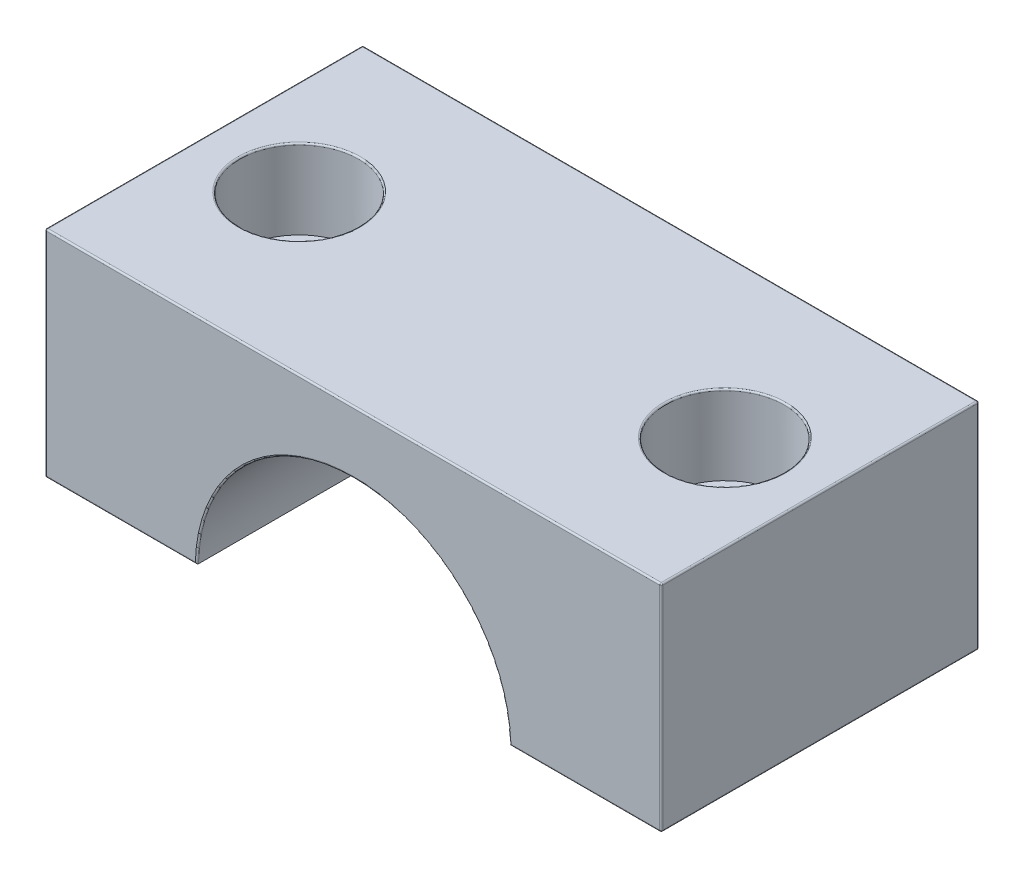
ISO-10303-21;
HEADER;
FILE_DESCRIPTION(('STEP AP214'),'2;1');
FILE_NAME('part.step','',(''),(''),'','','');
FILE_SCHEMA(('AUTOMOTIVE_DESIGN { 1 0 10303 214 1 1 1 1 }'));
ENDSEC;
DATA;
#1=APPLICATION_CONTEXT('core data for automotive mechanical design processes');
#2=APPLICATION_PROTOCOL_DEFINITION('international standard','automotive_design',2000,#1);
#3=PRODUCT_CONTEXT('',#1,'mechanical');
#4=PRODUCT('Part','Part','',(#3));
#5=PRODUCT_RELATED_PRODUCT_CATEGORY('part','',(#4));
#6=PRODUCT_DEFINITION_FORMATION('','',#4);
#7=PRODUCT_DEFINITION_CONTEXT('part definition',#1,'design');
#8=PRODUCT_DEFINITION('design','',#6,#7);
#9=PRODUCT_DEFINITION_SHAPE('','',#8);
#10=(LENGTH_UNIT() NAMED_UNIT(*) SI_UNIT(.MILLI.,.METRE.));
#11=(NAMED_UNIT(*) PLANE_ANGLE_UNIT() SI_UNIT($,.RADIAN.));
#12=(NAMED_UNIT(*) SI_UNIT($,.STERADIAN.) SOLID_ANGLE_UNIT());
#13=UNCERTAINTY_MEASURE_WITH_UNIT(LENGTH_MEASURE(1.E-05),#10,'distance_accuracy_value','');
#14=(GEOMETRIC_REPRESENTATION_CONTEXT(3) GLOBAL_UNCERTAINTY_ASSIGNED_CONTEXT((#13)) GLOBAL_UNIT_ASSIGNED_CONTEXT((#10,
#11,#12)) REPRESENTATION_CONTEXT('',''));
#15=CARTESIAN_POINT('',(0.,0.,0.));
#16=DIRECTION('',(0.,0.,1.));
#17=DIRECTION('',(1.,0.,0.));
#18=AXIS2_PLACEMENT_3D('',#15,#16,#17);
#19=CARTESIAN_POINT('',(-24.638,0.25,12.7));
#20=DIRECTION('',(1.,0.,0.));
#21=DIRECTION('',(0.,0.,-1.));
#22=AXIS2_PLACEMENT_3D('',#19,#20,#21);
#23=PLANE('',#22);
#24=DIRECTION('',(0.,-1.,0.));
#25=VECTOR('',#24,1.);
#26=CARTESIAN_POINT('',(-24.638,0.25,-12.573));
#27=LINE('',#26,#25);
#28=CARTESIAN_POINT('',(-24.638,17.3355,-12.573));
#29=VERTEX_POINT('',#28);
#30=CARTESIAN_POINT('',(-24.638,0.377,-12.573));
#31=VERTEX_POINT('',#30);
#32=EDGE_CURVE('E235',#29,#31,#27,.T.);
#33=ORIENTED_EDGE('',*,*,#32,.T.);
#34=DIRECTION('',(0.,0.,-1.));
#35=VECTOR('',#34,1.);
#36=CARTESIAN_POINT('',(-24.638,0.377,12.7));
#37=LINE('',#36,#35);
#38=CARTESIAN_POINT('',(-24.638,0.377,12.573));
#39=VERTEX_POINT('',#38);
#40=EDGE_CURVE('E237',#31,#39,#37,.F.);
#41=ORIENTED_EDGE('',*,*,#40,.T.);
#42=DIRECTION('',(0.,-1.,0.));
#43=VECTOR('',#42,1.);
#44=CARTESIAN_POINT('',(-24.638,17.4625,12.573));
#45=LINE('',#44,#43);
#46=CARTESIAN_POINT('',(-24.638,17.3355,12.573));
#47=VERTEX_POINT('',#46);
#48=EDGE_CURVE('E231',#39,#47,#45,.F.);
#49=ORIENTED_EDGE('',*,*,#48,.T.);
#50=DIRECTION('',(0.,0.,-1.));
#51=VECTOR('',#50,1.);
#52=CARTESIAN_POINT('',(-24.638,17.3355,12.7));
#53=LINE('',#52,#51);
#54=EDGE_CURVE('E233',#47,#29,#53,.T.);
#55=ORIENTED_EDGE('',*,*,#54,.T.);
#56=EDGE_LOOP('',(#33,#41,#49,#55));
#57=FACE_BOUND('',#56,.T.);
#58=ADVANCED_FACE('F41',(#57),#23,.F.);
#59=CARTESIAN_POINT('',(-24.638,0.25,12.7));
#60=DIRECTION('',(0.,1.,0.));
#61=DIRECTION('',(0.,0.,1.));
#62=AXIS2_PLACEMENT_3D('',#59,#60,#61);
#63=PLANE('',#62);
#64=CARTESIAN_POINT('',(-17.018,0.25,0.));
#65=DIRECTION('',(0.,1.,0.));
#66=DIRECTION('',(0.,0.,1.));
#67=AXIS2_PLACEMENT_3D('',#64,#65,#66);
#68=CIRCLE('',#67,3.175);
#69=CARTESIAN_POINT('',(-17.018,0.25,3.175));
#70=VERTEX_POINT('',#69);
#71=EDGE_CURVE('E195',#70,#70,#68,.T.);
#72=ORIENTED_EDGE('',*,*,#71,.T.);
#73=EDGE_LOOP('',(#72));
#74=FACE_BOUND('',#73,.T.);
#75=DIRECTION('',(0.,0.,-1.));
#76=VECTOR('',#75,1.);
#77=CARTESIAN_POINT('',(-24.511,0.25,12.7));
#78=LINE('',#77,#76);
#79=CARTESIAN_POINT('',(-24.511,0.25,12.573));
#80=VERTEX_POINT('',#79);
#81=CARTESIAN_POINT('',(-24.511,0.25,-12.573));
#82=VERTEX_POINT('',#81);
#83=EDGE_CURVE('E210',#80,#82,#78,.T.);
#84=ORIENTED_EDGE('',*,*,#83,.T.);
#85=DIRECTION('',(1.,0.,0.));
#86=VECTOR('',#85,1.);
#87=CARTESIAN_POINT('',(-24.638,0.25,-12.573));
#88=LINE('',#87,#86);
#89=CARTESIAN_POINT('',(-12.49749974995,0.25,-12.573));
#90=VERTEX_POINT('',#89);
#91=EDGE_CURVE('E212',#82,#90,#88,.T.);
#92=ORIENTED_EDGE('',*,*,#91,.T.);
#93=DIRECTION('',(0.,0.,-1.));
#94=VECTOR('',#93,1.);
#95=CARTESIAN_POINT('',(-12.49749974995,0.25,12.7));
#96=LINE('',#95,#94);
#97=CARTESIAN_POINT('',(-12.49749974995,0.25,12.573));
#98=VERTEX_POINT('',#97);
#99=EDGE_CURVE('E189',#98,#90,#96,.T.);
#100=ORIENTED_EDGE('',*,*,#99,.F.);
#101=DIRECTION('',(1.,0.,0.));
#102=VECTOR('',#101,1.);
#103=CARTESIAN_POINT('',(-24.638,0.25,12.573));
#104=LINE('',#103,#102);
#105=EDGE_CURVE('E208',#98,#80,#104,.F.);
#106=ORIENTED_EDGE('',*,*,#105,.T.);
#107=EDGE_LOOP('',(#84,#92,#100,#106));
#108=FACE_BOUND('',#107,.T.);
#109=ADVANCED_FACE('F366',(#74,#108),#63,.F.);
#110=CARTESIAN_POINT('',(0.,0.,12.7));
#111=DIRECTION('',(0.,0.,-1.));
#112=DIRECTION('',(-1.,0.,0.));
#113=AXIS2_PLACEMENT_3D('',#110,#111,#112);
#114=CYLINDRICAL_SURFACE('',#113,12.5);
#115=ORIENTED_EDGE('',*,*,#99,.T.);
#116=CARTESIAN_POINT('',(0.,0.,-12.573));
#117=DIRECTION('',(0.,0.,1.));
#118=DIRECTION('',(1.,0.,0.));
#119=AXIS2_PLACEMENT_3D('',#116,#117,#118);
#120=CIRCLE('',#119,12.5);
#121=CARTESIAN_POINT('',(12.49749974995,0.25,-12.573));
#122=VERTEX_POINT('',#121);
#123=EDGE_CURVE('E229',#90,#122,#120,.F.);
#124=ORIENTED_EDGE('',*,*,#123,.T.);
#125=DIRECTION('',(0.,0.,-1.));
#126=VECTOR('',#125,1.);
#127=CARTESIAN_POINT('',(12.49749974995,0.25,12.7));
#128=LINE('',#127,#126);
#129=CARTESIAN_POINT('',(12.49749974995,0.25,12.573));
#130=VERTEX_POINT('',#129);
#131=EDGE_CURVE('E192',#130,#122,#128,.T.);
#132=ORIENTED_EDGE('',*,*,#131,.F.);
#133=CARTESIAN_POINT('',(0.,0.,12.573));
#134=DIRECTION('',(0.,0.,1.));
#135=DIRECTION('',(1.,0.,0.));
#136=AXIS2_PLACEMENT_3D('',#133,#134,#135);
#137=CIRCLE('',#136,12.5);
#138=EDGE_CURVE('E227',#130,#98,#137,.T.);
#139=ORIENTED_EDGE('',*,*,#138,.T.);
#140=EDGE_LOOP('',(#115,#124,#132,#139));
#141=FACE_BOUND('',#140,.T.);
#142=ADVANCED_FACE('F373',(#141),#114,.F.);
#143=CARTESIAN_POINT('',(12.49749974995,0.25,12.7));
#144=DIRECTION('',(0.,1.,0.));
#145=DIRECTION('',(0.,0.,1.));
#146=AXIS2_PLACEMENT_3D('',#143,#144,#145);
#147=PLANE('',#146);
#148=CARTESIAN_POINT('',(17.018,0.25,0.));
#149=DIRECTION('',(0.,1.,0.));
#150=DIRECTION('',(0.,0.,1.));
#151=AXIS2_PLACEMENT_3D('',#148,#149,#150);
#152=CIRCLE('',#151,3.175);
#153=CARTESIAN_POINT('',(17.018,0.25,3.175));
#154=VERTEX_POINT('',#153);
#155=EDGE_CURVE('E542',#154,#154,#152,.T.);
#156=ORIENTED_EDGE('',*,*,#155,.T.);
#157=EDGE_LOOP('',(#156));
#158=FACE_BOUND('',#157,.T.);
#159=ORIENTED_EDGE('',*,*,#131,.T.);
#160=DIRECTION('',(1.,0.,0.));
#161=VECTOR('',#160,1.);
#162=CARTESIAN_POINT('',(12.49749974995,0.25,-12.573));
#163=LINE('',#162,#161);
#164=CARTESIAN_POINT('',(24.511,0.25,-12.573));
#165=VERTEX_POINT('',#164);
#166=EDGE_CURVE('E206',#122,#165,#163,.T.);
#167=ORIENTED_EDGE('',*,*,#166,.T.);
#168=DIRECTION('',(0.,0.,-1.));
#169=VECTOR('',#168,1.);
#170=CARTESIAN_POINT('',(24.511,0.25,12.7));
#171=LINE('',#170,#169);
#172=CARTESIAN_POINT('',(24.511,0.25,12.573));
#173=VERTEX_POINT('',#172);
#174=EDGE_CURVE('E203',#165,#173,#171,.F.);
#175=ORIENTED_EDGE('',*,*,#174,.T.);
#176=DIRECTION('',(1.,0.,0.));
#177=VECTOR('',#176,1.);
#178=CARTESIAN_POINT('',(12.49749974995,0.25,12.573));
#179=LINE('',#178,#177);
#180=EDGE_CURVE('E201',#173,#130,#179,.F.);
#181=ORIENTED_EDGE('',*,*,#180,.T.);
#182=EDGE_LOOP('',(#159,#167,#175,#181));
#183=FACE_BOUND('',#182,.T.);
#184=ADVANCED_FACE('F448',(#158,#183),#147,.F.);
#185=CARTESIAN_POINT('',(24.638,17.4625,12.7));
#186=DIRECTION('',(-1.,0.,0.));
#187=DIRECTION('',(0.,-1.,0.));
#188=AXIS2_PLACEMENT_3D('',#185,#186,#187);
#189=PLANE('',#188);
#190=DIRECTION('',(0.,1.,0.));
#191=VECTOR('',#190,1.);
#192=CARTESIAN_POINT('',(24.638,0.25,12.573));
#193=LINE('',#192,#191);
#194=CARTESIAN_POINT('',(24.638,17.3355,12.573));
#195=VERTEX_POINT('',#194);
#196=CARTESIAN_POINT('',(24.638,0.376999999999999,12.573));
#197=VERTEX_POINT('',#196);
#198=EDGE_CURVE('E157',#195,#197,#193,.F.);
#199=ORIENTED_EDGE('',*,*,#198,.T.);
#200=DIRECTION('',(0.,0.,-1.));
#201=VECTOR('',#200,1.);
#202=CARTESIAN_POINT('',(24.638,0.376999999999999,12.7));
#203=LINE('',#202,#201);
#204=CARTESIAN_POINT('',(24.638,0.376999999999999,-12.573));
#205=VERTEX_POINT('',#204);
#206=EDGE_CURVE('E199',#197,#205,#203,.T.);
#207=ORIENTED_EDGE('',*,*,#206,.T.);
#208=DIRECTION('',(0.,1.,0.));
#209=VECTOR('',#208,1.);
#210=CARTESIAN_POINT('',(24.638,17.4625,-12.573));
#211=LINE('',#210,#209);
#212=CARTESIAN_POINT('',(24.638,17.3355,-12.573));
#213=VERTEX_POINT('',#212);
#214=EDGE_CURVE('E160',#205,#213,#211,.T.);
#215=ORIENTED_EDGE('',*,*,#214,.T.);
#216=DIRECTION('',(0.,0.,-1.));
#217=VECTOR('',#216,1.);
#218=CARTESIAN_POINT('',(24.638,17.3355,12.7));
#219=LINE('',#218,#217);
#220=EDGE_CURVE('E152',#213,#195,#219,.F.);
#221=ORIENTED_EDGE('',*,*,#220,.T.);
#222=EDGE_LOOP('',(#199,#207,#215,#221));
#223=FACE_BOUND('',#222,.T.);
#224=ADVANCED_FACE('F154',(#223),#189,.F.);
#225=CARTESIAN_POINT('',(-24.638,17.4625,12.7));
#226=DIRECTION('',(0.,-1.,0.));
#227=DIRECTION('',(1.,0.,0.));
#228=AXIS2_PLACEMENT_3D('',#225,#226,#227);
#229=PLANE('',#228);
#230=CARTESIAN_POINT('',(-17.018,17.4625,0.));
#231=DIRECTION('',(0.,-1.,0.));
#232=DIRECTION('',(1.,0.,0.));
#233=AXIS2_PLACEMENT_3D('',#230,#231,#232);
#234=CIRCLE('',#233,4.8895);
#235=CARTESIAN_POINT('',(-12.1285,17.4625,0.));
#236=VERTEX_POINT('',#235);
#237=EDGE_CURVE('E250',#236,#236,#234,.T.);
#238=ORIENTED_EDGE('',*,*,#237,.T.);
#239=EDGE_LOOP('',(#238));
#240=FACE_BOUND('',#239,.T.);
#241=CARTESIAN_POINT('',(17.018,17.4625,0.));
#242=DIRECTION('',(0.,-1.,0.));
#243=DIRECTION('',(1.,0.,0.));
#244=AXIS2_PLACEMENT_3D('',#241,#242,#243);
#245=CIRCLE('',#244,4.8895);
#246=CARTESIAN_POINT('',(21.9075,17.4625,0.));
#247=VERTEX_POINT('',#246);
#248=EDGE_CURVE('E247',#247,#247,#245,.T.);
#249=ORIENTED_EDGE('',*,*,#248,.T.);
#250=EDGE_LOOP('',(#249));
#251=FACE_BOUND('',#250,.T.);
#252=DIRECTION('',(0.,0.,-1.));
#253=VECTOR('',#252,1.);
#254=CARTESIAN_POINT('',(24.511,17.4625,12.7));
#255=LINE('',#254,#253);
#256=CARTESIAN_POINT('',(24.511,17.4625,12.573));
#257=VERTEX_POINT('',#256);
#258=CARTESIAN_POINT('',(24.511,17.4625,-12.573));
#259=VERTEX_POINT('',#258);
#260=EDGE_CURVE('E171',#257,#259,#255,.T.);
#261=ORIENTED_EDGE('',*,*,#260,.T.);
#262=DIRECTION('',(-1.,0.,0.));
#263=VECTOR('',#262,1.);
#264=CARTESIAN_POINT('',(-24.638,17.4625,-12.573));
#265=LINE('',#264,#263);
#266=CARTESIAN_POINT('',(-24.511,17.4625,-12.573));
#267=VERTEX_POINT('',#266);
#268=EDGE_CURVE('E245',#259,#267,#265,.T.);
#269=ORIENTED_EDGE('',*,*,#268,.T.);
#270=DIRECTION('',(0.,0.,-1.));
#271=VECTOR('',#270,1.);
#272=CARTESIAN_POINT('',(-24.511,17.4625,12.7));
#273=LINE('',#272,#271);
#274=CARTESIAN_POINT('',(-24.511,17.4625,12.573));
#275=VERTEX_POINT('',#274);
#276=EDGE_CURVE('E242',#267,#275,#273,.F.);
#277=ORIENTED_EDGE('',*,*,#276,.T.);
#278=DIRECTION('',(-1.,0.,0.));
#279=VECTOR('',#278,1.);
#280=CARTESIAN_POINT('',(24.638,17.4625,12.573));
#281=LINE('',#280,#279);
#282=EDGE_CURVE('E240',#275,#257,#281,.F.);
#283=ORIENTED_EDGE('',*,*,#282,.T.);
#284=EDGE_LOOP('',(#261,#269,#277,#283));
#285=FACE_BOUND('',#284,.T.);
#286=ADVANCED_FACE('F413',(#240,#251,#285),#229,.F.);
#287=CARTESIAN_POINT('',(0.,0.,12.7));
#288=DIRECTION('',(0.,0.,1.));
#289=DIRECTION('',(1.,0.,0.));
#290=AXIS2_PLACEMENT_3D('',#287,#288,#289);
#291=PLANE('',#290);
#292=DIRECTION('',(0.,1.,0.));
#293=VECTOR('',#292,1.);
#294=CARTESIAN_POINT('',(24.511,17.4625,12.7));
#295=LINE('',#294,#293);
#296=CARTESIAN_POINT('',(24.511,0.377,12.7));
#297=VERTEX_POINT('',#296);
#298=CARTESIAN_POINT('',(24.511,17.3355,12.7));
#299=VERTEX_POINT('',#298);
#300=EDGE_CURVE('E50',#297,#299,#295,.T.);
#301=ORIENTED_EDGE('',*,*,#300,.T.);
#302=DIRECTION('',(-1.,0.,0.));
#303=VECTOR('',#302,1.);
#304=CARTESIAN_POINT('',(-24.638,17.3355,12.7));
#305=LINE('',#304,#303);
#306=CARTESIAN_POINT('',(-24.511,17.3355,12.7));
#307=VERTEX_POINT('',#306);
#308=EDGE_CURVE('E11',#299,#307,#305,.T.);
#309=ORIENTED_EDGE('',*,*,#308,.T.);
#310=DIRECTION('',(0.,-1.,0.));
#311=VECTOR('',#310,1.);
#312=CARTESIAN_POINT('',(-24.511,0.25,12.7));
#313=LINE('',#312,#311);
#314=CARTESIAN_POINT('',(-24.511,0.377,12.7));
#315=VERTEX_POINT('',#314);
#316=EDGE_CURVE('E259',#307,#315,#313,.T.);
#317=ORIENTED_EDGE('',*,*,#316,.T.);
#318=DIRECTION('',(1.,0.,0.));
#319=VECTOR('',#318,1.);
#320=CARTESIAN_POINT('',(-12.49749974995,0.377,12.7));
#321=LINE('',#320,#319);
#322=CARTESIAN_POINT('',(-12.6213707654914,0.377,12.7));
#323=VERTEX_POINT('',#322);
#324=EDGE_CURVE('E261',#315,#323,#321,.T.);
#325=ORIENTED_EDGE('',*,*,#324,.T.);
#326=CARTESIAN_POINT('',(0.,0.,12.7));
#327=DIRECTION('',(0.,0.,1.));
#328=DIRECTION('',(1.,0.,0.));
#329=AXIS2_PLACEMENT_3D('',#326,#327,#328);
#330=CIRCLE('',#329,12.627);
#331=CARTESIAN_POINT('',(12.6213707654914,0.377,12.7));
#332=VERTEX_POINT('',#331);
#333=EDGE_CURVE('E263',#323,#332,#330,.F.);
#334=ORIENTED_EDGE('',*,*,#333,.T.);
#335=DIRECTION('',(1.,0.,0.));
#336=VECTOR('',#335,1.);
#337=CARTESIAN_POINT('',(24.638,0.377,12.7));
#338=LINE('',#337,#336);
#339=EDGE_CURVE('E61',#332,#297,#338,.T.);
#340=ORIENTED_EDGE('',*,*,#339,.T.);
#341=EDGE_LOOP('',(#301,#309,#317,#325,#334,#340));
#342=FACE_BOUND('',#341,.T.);
#343=ADVANCED_FACE('F420',(#342),#291,.T.);
#344=CARTESIAN_POINT('',(0.,0.,-12.7));
#345=DIRECTION('',(0.,0.,1.));
#346=DIRECTION('',(1.,0.,0.));
#347=AXIS2_PLACEMENT_3D('',#344,#345,#346);
#348=PLANE('',#347);
#349=CARTESIAN_POINT('',(0.,0.,-12.7));
#350=DIRECTION('',(0.,0.,1.));
#351=DIRECTION('',(1.,0.,0.));
#352=AXIS2_PLACEMENT_3D('',#349,#350,#351);
#353=CIRCLE('',#352,12.627);
#354=CARTESIAN_POINT('',(12.6213707654914,0.377,-12.7));
#355=VERTEX_POINT('',#354);
#356=CARTESIAN_POINT('',(-12.6213707654914,0.377,-12.7));
#357=VERTEX_POINT('',#356);
#358=EDGE_CURVE('E222',#355,#357,#353,.T.);
#359=ORIENTED_EDGE('',*,*,#358,.T.);
#360=DIRECTION('',(1.,0.,0.));
#361=VECTOR('',#360,1.);
#362=CARTESIAN_POINT('',(0.,0.377,-12.7));
#363=LINE('',#362,#361);
#364=CARTESIAN_POINT('',(-24.511,0.377,-12.7));
#365=VERTEX_POINT('',#364);
#366=EDGE_CURVE('E224',#357,#365,#363,.F.);
#367=ORIENTED_EDGE('',*,*,#366,.T.);
#368=DIRECTION('',(0.,-1.,0.));
#369=VECTOR('',#368,1.);
#370=CARTESIAN_POINT('',(-24.511,0.,-12.7));
#371=LINE('',#370,#369);
#372=CARTESIAN_POINT('',(-24.511,17.3355,-12.7));
#373=VERTEX_POINT('',#372);
#374=EDGE_CURVE('E216',#365,#373,#371,.F.);
#375=ORIENTED_EDGE('',*,*,#374,.T.);
#376=DIRECTION('',(-1.,0.,0.));
#377=VECTOR('',#376,1.);
#378=CARTESIAN_POINT('',(0.,17.3355,-12.7));
#379=LINE('',#378,#377);
#380=CARTESIAN_POINT('',(24.511,17.3355,-12.7));
#381=VERTEX_POINT('',#380);
#382=EDGE_CURVE('E214',#373,#381,#379,.F.);
#383=ORIENTED_EDGE('',*,*,#382,.T.);
#384=DIRECTION('',(0.,1.,0.));
#385=VECTOR('',#384,1.);
#386=CARTESIAN_POINT('',(24.511,0.,-12.7));
#387=LINE('',#386,#385);
#388=CARTESIAN_POINT('',(24.511,0.377,-12.7));
#389=VERTEX_POINT('',#388);
#390=EDGE_CURVE('E218',#381,#389,#387,.F.);
#391=ORIENTED_EDGE('',*,*,#390,.T.);
#392=DIRECTION('',(1.,0.,0.));
#393=VECTOR('',#392,1.);
#394=CARTESIAN_POINT('',(0.,0.377,-12.7));
#395=LINE('',#394,#393);
#396=EDGE_CURVE('E220',#389,#355,#395,.F.);
#397=ORIENTED_EDGE('',*,*,#396,.T.);
#398=EDGE_LOOP('',(#359,#367,#375,#383,#391,#397));
#399=FACE_BOUND('',#398,.T.);
#400=ADVANCED_FACE('F454',(#399),#348,.F.);
#401=CARTESIAN_POINT('',(-17.018,11.1125,0.));
#402=DIRECTION('',(0.,1.,0.));
#403=DIRECTION('',(-1.,0.,0.));
#404=AXIS2_PLACEMENT_3D('',#401,#402,#403);
#405=CYLINDRICAL_SURFACE('',#404,4.7625);
#406=CARTESIAN_POINT('',(-17.018,17.3355,0.));
#407=DIRECTION('',(0.,-1.,0.));
#408=DIRECTION('',(1.,0.,0.));
#409=AXIS2_PLACEMENT_3D('',#406,#407,#408);
#410=CIRCLE('',#409,4.7625);
#411=CARTESIAN_POINT('',(-12.2555,17.3355,0.));
#412=VERTEX_POINT('',#411);
#413=EDGE_CURVE('E253',#412,#412,#410,.F.);
#414=ORIENTED_EDGE('',*,*,#413,.T.);
#415=EDGE_LOOP('',(#414));
#416=FACE_BOUND('',#415,.T.);
#417=CARTESIAN_POINT('',(-17.018,11.1125,0.));
#418=DIRECTION('',(0.,1.,0.));
#419=DIRECTION('',(-1.,0.,0.));
#420=AXIS2_PLACEMENT_3D('',#417,#418,#419);
#421=CIRCLE('',#420,4.7625);
#422=CARTESIAN_POINT('',(-21.7805,11.1125,0.));
#423=VERTEX_POINT('',#422);
#424=EDGE_CURVE('E535',#423,#423,#421,.T.);
#425=ORIENTED_EDGE('',*,*,#424,.F.);
#426=EDGE_LOOP('',(#425));
#427=FACE_BOUND('',#426,.T.);
#428=ADVANCED_FACE('F528',(#416,#427),#405,.F.);
#429=CARTESIAN_POINT('',(-17.018,11.1125,0.));
#430=DIRECTION('',(0.,1.,0.));
#431=DIRECTION('',(-1.,0.,0.));
#432=AXIS2_PLACEMENT_3D('',#429,#430,#431);
#433=PLANE('',#432);
#434=CARTESIAN_POINT('',(-17.018,11.1125,0.));
#435=DIRECTION('',(0.,1.,0.));
#436=DIRECTION('',(-1.,0.,0.));
#437=AXIS2_PLACEMENT_3D('',#434,#435,#436);
#438=CIRCLE('',#437,3.175);
#439=CARTESIAN_POINT('',(-20.193,11.1125,0.));
#440=VERTEX_POINT('',#439);
#441=EDGE_CURVE('E550',#440,#440,#438,.T.);
#442=ORIENTED_EDGE('',*,*,#441,.F.);
#443=EDGE_LOOP('',(#442));
#444=FACE_BOUND('',#443,.T.);
#445=ORIENTED_EDGE('',*,*,#424,.T.);
#446=EDGE_LOOP('',(#445));
#447=FACE_BOUND('',#446,.T.);
#448=ADVANCED_FACE('F531',(#444,#447),#433,.T.);
#449=CARTESIAN_POINT('',(17.018,11.1125,0.));
#450=DIRECTION('',(0.,1.,0.));
#451=DIRECTION('',(-1.,0.,0.));
#452=AXIS2_PLACEMENT_3D('',#449,#450,#451);
#453=CYLINDRICAL_SURFACE('',#452,4.7625);
#454=CARTESIAN_POINT('',(17.018,17.3355,0.));
#455=DIRECTION('',(0.,-1.,0.));
#456=DIRECTION('',(1.,0.,0.));
#457=AXIS2_PLACEMENT_3D('',#454,#455,#456);
#458=CIRCLE('',#457,4.7625);
#459=CARTESIAN_POINT('',(21.7805,17.3355,0.));
#460=VERTEX_POINT('',#459);
#461=EDGE_CURVE('E256',#460,#460,#458,.F.);
#462=ORIENTED_EDGE('',*,*,#461,.T.);
#463=EDGE_LOOP('',(#462));
#464=FACE_BOUND('',#463,.T.);
#465=CARTESIAN_POINT('',(17.018,11.1125,0.));
#466=DIRECTION('',(0.,1.,0.));
#467=DIRECTION('',(-1.,0.,0.));
#468=AXIS2_PLACEMENT_3D('',#465,#466,#467);
#469=CIRCLE('',#468,4.7625);
#470=CARTESIAN_POINT('',(12.2555,11.1125,0.));
#471=VERTEX_POINT('',#470);
#472=EDGE_CURVE('E537',#471,#471,#469,.T.);
#473=ORIENTED_EDGE('',*,*,#472,.F.);
#474=EDGE_LOOP('',(#473));
#475=FACE_BOUND('',#474,.T.);
#476=ADVANCED_FACE('F560',(#464,#475),#453,.F.);
#477=CARTESIAN_POINT('',(17.018,11.1125,0.));
#478=DIRECTION('',(0.,1.,0.));
#479=DIRECTION('',(-1.,0.,0.));
#480=AXIS2_PLACEMENT_3D('',#477,#478,#479);
#481=PLANE('',#480);
#482=CARTESIAN_POINT('',(17.018,11.1125,0.));
#483=DIRECTION('',(0.,1.,0.));
#484=DIRECTION('',(-1.,0.,0.));
#485=AXIS2_PLACEMENT_3D('',#482,#483,#484);
#486=CIRCLE('',#485,3.175);
#487=CARTESIAN_POINT('',(13.843,11.1125,0.));
#488=VERTEX_POINT('',#487);
#489=EDGE_CURVE('E546',#488,#488,#486,.T.);
#490=ORIENTED_EDGE('',*,*,#489,.F.);
#491=EDGE_LOOP('',(#490));
#492=FACE_BOUND('',#491,.T.);
#493=ORIENTED_EDGE('',*,*,#472,.T.);
#494=EDGE_LOOP('',(#493));
#495=FACE_BOUND('',#494,.T.);
#496=ADVANCED_FACE('F566',(#492,#495),#481,.T.);
#497=CARTESIAN_POINT('',(17.018,-38.1,0.));
#498=DIRECTION('',(0.,1.,0.));
#499=DIRECTION('',(-1.,0.,0.));
#500=AXIS2_PLACEMENT_3D('',#497,#498,#499);
#501=CYLINDRICAL_SURFACE('',#500,3.175);
#502=ORIENTED_EDGE('',*,*,#489,.T.);
#503=EDGE_LOOP('',(#502));
#504=FACE_BOUND('',#503,.T.);
#505=ORIENTED_EDGE('',*,*,#155,.F.);
#506=EDGE_LOOP('',(#505));
#507=FACE_BOUND('',#506,.T.);
#508=ADVANCED_FACE('F642',(#504,#507),#501,.F.);
#509=CARTESIAN_POINT('',(-17.018,-38.1,0.));
#510=DIRECTION('',(0.,1.,0.));
#511=DIRECTION('',(-1.,0.,0.));
#512=AXIS2_PLACEMENT_3D('',#509,#510,#511);
#513=CYLINDRICAL_SURFACE('',#512,3.175);
#514=ORIENTED_EDGE('',*,*,#441,.T.);
#515=EDGE_LOOP('',(#514));
#516=FACE_BOUND('',#515,.T.);
#517=ORIENTED_EDGE('',*,*,#71,.F.);
#518=EDGE_LOOP('',(#517));
#519=FACE_BOUND('',#518,.T.);
#520=ADVANCED_FACE('F516',(#516,#519),#513,.F.);
#521=CARTESIAN_POINT('',(-24.511,0.,12.573));
#522=DIRECTION('',(0.,1.,0.));
#523=DIRECTION('',(0.,0.,1.));
#524=AXIS2_PLACEMENT_3D('',#521,#522,#523);
#525=CYLINDRICAL_SURFACE('',#524,0.127);
#526=CARTESIAN_POINT('',(-24.511,17.3355,12.573));
#527=DIRECTION('',(0.,1.,0.));
#528=DIRECTION('',(0.,0.,1.));
#529=AXIS2_PLACEMENT_3D('',#526,#527,#528);
#530=CIRCLE('',#529,0.127);
#531=EDGE_CURVE('E434',#47,#307,#530,.T.);
#532=ORIENTED_EDGE('',*,*,#531,.F.);
#533=ORIENTED_EDGE('',*,*,#48,.F.);
#534=CARTESIAN_POINT('',(-24.511,0.377,12.573));
#535=DIRECTION('',(0.,-1.,0.));
#536=DIRECTION('',(0.,0.,-1.));
#537=AXIS2_PLACEMENT_3D('',#534,#535,#536);
#538=CIRCLE('',#537,0.127);
#539=EDGE_CURVE('E428',#315,#39,#538,.T.);
#540=ORIENTED_EDGE('',*,*,#539,.F.);
#541=ORIENTED_EDGE('',*,*,#316,.F.);
#542=EDGE_LOOP('',(#532,#533,#540,#541));
#543=FACE_BOUND('',#542,.T.);
#544=ADVANCED_FACE('F430',(#543),#525,.T.);
#545=CARTESIAN_POINT('',(-24.511,17.3355,12.7));
#546=DIRECTION('',(0.,0.,-1.));
#547=DIRECTION('',(-1.,0.,0.));
#548=AXIS2_PLACEMENT_3D('',#545,#546,#547);
#549=CYLINDRICAL_SURFACE('',#548,0.127);
#550=CARTESIAN_POINT('',(-24.511,17.3355,-12.573));
#551=DIRECTION('',(0.,0.,-1.));
#552=DIRECTION('',(-1.,0.,0.));
#553=AXIS2_PLACEMENT_3D('',#550,#551,#552);
#554=CIRCLE('',#553,0.127);
#555=EDGE_CURVE('E472',#29,#267,#554,.T.);
#556=ORIENTED_EDGE('',*,*,#555,.F.);
#557=ORIENTED_EDGE('',*,*,#54,.F.);
#558=CARTESIAN_POINT('',(-24.511,17.3355,12.573));
#559=DIRECTION('',(0.,0.,1.));
#560=DIRECTION('',(1.,0.,0.));
#561=AXIS2_PLACEMENT_3D('',#558,#559,#560);
#562=CIRCLE('',#561,0.127);
#563=EDGE_CURVE('E482',#275,#47,#562,.T.);
#564=ORIENTED_EDGE('',*,*,#563,.F.);
#565=ORIENTED_EDGE('',*,*,#276,.F.);
#566=EDGE_LOOP('',(#556,#557,#564,#565));
#567=FACE_BOUND('',#566,.T.);
#568=ADVANCED_FACE('F489',(#567),#549,.T.);
#569=CARTESIAN_POINT('',(-24.511,0.25,-12.573));
#570=DIRECTION('',(0.,-1.,0.));
#571=DIRECTION('',(0.,0.,-1.));
#572=AXIS2_PLACEMENT_3D('',#569,#570,#571);
#573=CYLINDRICAL_SURFACE('',#572,0.127);
#574=CARTESIAN_POINT('',(-24.511,0.377,-12.573));
#575=DIRECTION('',(0.,-1.,0.));
#576=DIRECTION('',(0.,0.,-1.));
#577=AXIS2_PLACEMENT_3D('',#574,#575,#576);
#578=CIRCLE('',#577,0.127);
#579=EDGE_CURVE('E473',#31,#365,#578,.T.);
#580=ORIENTED_EDGE('',*,*,#579,.F.);
#581=ORIENTED_EDGE('',*,*,#32,.F.);
#582=CARTESIAN_POINT('',(-24.511,17.3355,-12.573));
#583=DIRECTION('',(0.,1.,0.));
#584=DIRECTION('',(0.,0.,1.));
#585=AXIS2_PLACEMENT_3D('',#582,#583,#584);
#586=CIRCLE('',#585,0.127);
#587=EDGE_CURVE('E467',#373,#29,#586,.T.);
#588=ORIENTED_EDGE('',*,*,#587,.F.);
#589=ORIENTED_EDGE('',*,*,#374,.F.);
#590=EDGE_LOOP('',(#580,#581,#588,#589));
#591=FACE_BOUND('',#590,.T.);
#592=ADVANCED_FACE('F468',(#591),#573,.T.);
#593=CARTESIAN_POINT('',(-24.511,0.377,12.7));
#594=DIRECTION('',(0.,0.,-1.));
#595=DIRECTION('',(-1.,0.,0.));
#596=AXIS2_PLACEMENT_3D('',#593,#594,#595);
#597=CYLINDRICAL_SURFACE('',#596,0.127);
#598=CARTESIAN_POINT('',(-24.511,0.377,12.573));
#599=DIRECTION('',(0.,0.,1.));
#600=DIRECTION('',(1.,0.,0.));
#601=AXIS2_PLACEMENT_3D('',#598,#599,#600);
#602=CIRCLE('',#601,0.127);
#603=EDGE_CURVE('E45',#39,#80,#602,.T.);
#604=ORIENTED_EDGE('',*,*,#603,.F.);
#605=ORIENTED_EDGE('',*,*,#40,.F.);
#606=CARTESIAN_POINT('',(-24.511,0.377,-12.573));
#607=DIRECTION('',(0.,0.,-1.));
#608=DIRECTION('',(-1.,0.,0.));
#609=AXIS2_PLACEMENT_3D('',#606,#607,#608);
#610=CIRCLE('',#609,0.127);
#611=EDGE_CURVE('E439',#82,#31,#610,.T.);
#612=ORIENTED_EDGE('',*,*,#611,.F.);
#613=ORIENTED_EDGE('',*,*,#83,.F.);
#614=EDGE_LOOP('',(#604,#605,#612,#613));
#615=FACE_BOUND('',#614,.T.);
#616=ADVANCED_FACE('F493',(#615),#597,.T.);
#617=CARTESIAN_POINT('',(-24.511,0.377,12.573));
#618=DIRECTION('',(0.,0.,1.));
#619=DIRECTION('',(1.,0.,0.));
#620=AXIS2_PLACEMENT_3D('',#617,#618,#619);
#621=SPHERICAL_SURFACE('',#620,0.127);
#622=ORIENTED_EDGE('',*,*,#539,.T.);
#623=ORIENTED_EDGE('',*,*,#603,.T.);
#624=CARTESIAN_POINT('',(-24.511,0.377,12.573));
#625=DIRECTION('',(-1.,0.,0.));
#626=DIRECTION('',(0.,0.,1.));
#627=AXIS2_PLACEMENT_3D('',#624,#625,#626);
#628=CIRCLE('',#627,0.127);
#629=EDGE_CURVE('E436',#315,#80,#628,.F.);
#630=ORIENTED_EDGE('',*,*,#629,.F.);
#631=EDGE_LOOP('',(#622,#623,#630));
#632=FACE_BOUND('',#631,.T.);
#633=ADVANCED_FACE('F437',(#632),#621,.T.);
#634=CARTESIAN_POINT('',(-24.511,17.3355,12.573));
#635=DIRECTION('',(0.,0.,1.));
#636=DIRECTION('',(1.,0.,0.));
#637=AXIS2_PLACEMENT_3D('',#634,#635,#636);
#638=SPHERICAL_SURFACE('',#637,0.127);
#639=ORIENTED_EDGE('',*,*,#563,.T.);
#640=ORIENTED_EDGE('',*,*,#531,.T.);
#641=CARTESIAN_POINT('',(-24.511,17.3355,12.573));
#642=DIRECTION('',(-1.,0.,0.));
#643=DIRECTION('',(0.,0.,1.));
#644=AXIS2_PLACEMENT_3D('',#641,#642,#643);
#645=CIRCLE('',#644,0.127);
#646=EDGE_CURVE('E418',#275,#307,#645,.F.);
#647=ORIENTED_EDGE('',*,*,#646,.F.);
#648=EDGE_LOOP('',(#639,#640,#647));
#649=FACE_BOUND('',#648,.T.);
#650=ADVANCED_FACE('F486',(#649),#638,.T.);
#651=CARTESIAN_POINT('',(-24.511,17.3355,-12.573));
#652=DIRECTION('',(0.,0.,1.));
#653=DIRECTION('',(1.,0.,0.));
#654=AXIS2_PLACEMENT_3D('',#651,#652,#653);
#655=SPHERICAL_SURFACE('',#654,0.127);
#656=ORIENTED_EDGE('',*,*,#587,.T.);
#657=ORIENTED_EDGE('',*,*,#555,.T.);
#658=CARTESIAN_POINT('',(-24.511,17.3355,-12.573));
#659=DIRECTION('',(-1.,0.,0.));
#660=DIRECTION('',(0.,0.,1.));
#661=AXIS2_PLACEMENT_3D('',#658,#659,#660);
#662=CIRCLE('',#661,0.127);
#663=EDGE_CURVE('E410',#373,#267,#662,.F.);
#664=ORIENTED_EDGE('',*,*,#663,.F.);
#665=EDGE_LOOP('',(#656,#657,#664));
#666=FACE_BOUND('',#665,.T.);
#667=ADVANCED_FACE('F475',(#666),#655,.T.);
#668=CARTESIAN_POINT('',(-24.511,0.377,-12.573));
#669=DIRECTION('',(0.,0.,1.));
#670=DIRECTION('',(1.,0.,0.));
#671=AXIS2_PLACEMENT_3D('',#668,#669,#670);
#672=SPHERICAL_SURFACE('',#671,0.127);
#673=ORIENTED_EDGE('',*,*,#611,.T.);
#674=ORIENTED_EDGE('',*,*,#579,.T.);
#675=CARTESIAN_POINT('',(-24.511,0.377,-12.573));
#676=DIRECTION('',(-1.,0.,0.));
#677=DIRECTION('',(0.,0.,1.));
#678=AXIS2_PLACEMENT_3D('',#675,#676,#677);
#679=CIRCLE('',#678,0.127);
#680=EDGE_CURVE('E351',#82,#365,#679,.F.);
#681=ORIENTED_EDGE('',*,*,#680,.F.);
#682=EDGE_LOOP('',(#673,#674,#681));
#683=FACE_BOUND('',#682,.T.);
#684=ADVANCED_FACE('F339',(#683),#672,.T.);
#685=CARTESIAN_POINT('',(0.,0.377,12.573));
#686=DIRECTION('',(-1.,0.,0.));
#687=DIRECTION('',(0.,0.,1.));
#688=AXIS2_PLACEMENT_3D('',#685,#686,#687);
#689=CYLINDRICAL_SURFACE('',#688,0.127);
#690=ORIENTED_EDGE('',*,*,#629,.T.);
#691=ORIENTED_EDGE('',*,*,#105,.F.);
#692=CARTESIAN_POINT('',(-12.49749974995,0.25,12.573));
#693=CARTESIAN_POINT('',(-12.4974902880931,0.249990407258436,12.5787363210638));
#694=CARTESIAN_POINT('',(-12.497880035781,0.250387967320833,12.5844584360893));
#695=CARTESIAN_POINT('',(-12.4993756629396,0.251913919814583,12.5956600913597));
#696=CARTESIAN_POINT('',(-12.5004754187834,0.253036062928485,12.6011412817449));
#697=CARTESIAN_POINT('',(-12.5033074651116,0.255926355524248,12.6117360878037));
#698=CARTESIAN_POINT('',(-12.5050380666388,0.257692780084878,12.6168506417189));
#699=CARTESIAN_POINT('',(-12.5090267736161,0.261765175659096,12.6266482284224));
#700=CARTESIAN_POINT('',(-12.5112860401961,0.26407233432836,12.6313302792503));
#701=CARTESIAN_POINT('',(-12.5172161724119,0.270130157431337,12.6419851928896));
#702=CARTESIAN_POINT('',(-12.5210903585702,0.274089244982171,12.6477262683133));
#703=CARTESIAN_POINT('',(-12.5294294345404,0.282615691840613,12.6582445373409));
#704=CARTESIAN_POINT('',(-12.5338954360146,0.287184195982555,12.663019873177));
#705=CARTESIAN_POINT('',(-12.5449761540631,0.298525953873713,12.6732437593001));
#706=CARTESIAN_POINT('',(-12.5517731031691,0.305488116332445,12.6782842093654));
#707=CARTESIAN_POINT('',(-12.5658305812932,0.31989994179393,12.6867476801483));
#708=CARTESIAN_POINT('',(-12.573091584217,0.327350103355595,12.6901690164241));
#709=CARTESIAN_POINT('',(-12.5869127702702,0.341544146409579,12.6951510607156));
#710=CARTESIAN_POINT('',(-12.5934425045433,0.348255134735288,12.6968948755496));
#711=CARTESIAN_POINT('',(-12.6065834649553,0.361771576753984,12.6992697706414));
#712=CARTESIAN_POINT('',(-12.6131945035035,0.368576816376736,12.6999030538442));
#713=CARTESIAN_POINT('',(-12.6203240278583,0.375921562837713,12.699996562143));
#714=CARTESIAN_POINT('',(-12.6208474251306,0.376460793843604,12.6999999954097));
#715=CARTESIAN_POINT('',(-12.6213707654914,0.377,12.7));
#716=B_SPLINE_CURVE_WITH_KNOTS('',3,(#692,#693,#694,#695,#696,#697,#698,#699,#700,#701,#702,
#703,#704,#705,#706,#707,#708,#709,#710,#711,#712,#713,#714,#715),.UNSPECIFIED.,.F.,.F.,(4,2,2,
2,2,2,2,2,2,2,2,4),(0.,0.0171594810433418,0.0341729083203892,0.0511411162979605,
0.0681469480046781,0.0919480688234841,0.115794548603213,0.14849289627168,0.18122518722282,
0.209734335473674,0.238186866307018,0.240441277954726),.UNSPECIFIED.);
#717=EDGE_CURVE('E343',#323,#98,#716,.F.);
#718=ORIENTED_EDGE('',*,*,#717,.F.);
#719=ORIENTED_EDGE('',*,*,#324,.F.);
#720=EDGE_LOOP('',(#690,#691,#718,#719));
#721=FACE_BOUND('',#720,.T.);
#722=ADVANCED_FACE('F334',(#721),#689,.T.);
#723=CARTESIAN_POINT('',(0.,17.3355,12.573));
#724=DIRECTION('',(1.,0.,0.));
#725=DIRECTION('',(0.,1.,0.));
#726=AXIS2_PLACEMENT_3D('',#723,#724,#725);
#727=CYLINDRICAL_SURFACE('',#726,0.127);
#728=ORIENTED_EDGE('',*,*,#646,.T.);
#729=ORIENTED_EDGE('',*,*,#308,.F.);
#730=CARTESIAN_POINT('',(24.511,17.3355,12.573));
#731=DIRECTION('',(1.,0.,0.));
#732=DIRECTION('',(0.,0.,-1.));
#733=AXIS2_PLACEMENT_3D('',#730,#731,#732);
#734=CIRCLE('',#733,0.127);
#735=EDGE_CURVE('E175',#257,#299,#734,.T.);
#736=ORIENTED_EDGE('',*,*,#735,.F.);
#737=ORIENTED_EDGE('',*,*,#282,.F.);
#738=EDGE_LOOP('',(#728,#729,#736,#737));
#739=FACE_BOUND('',#738,.T.);
#740=ADVANCED_FACE('F338',(#739),#727,.T.);
#741=CARTESIAN_POINT('',(24.511,17.3355,12.7));
#742=DIRECTION('',(0.,0.,-1.));
#743=DIRECTION('',(-1.,0.,0.));
#744=AXIS2_PLACEMENT_3D('',#741,#742,#743);
#745=CYLINDRICAL_SURFACE('',#744,0.127);
#746=CARTESIAN_POINT('',(24.511,17.3355,-12.573));
#747=DIRECTION('',(0.,0.,-1.));
#748=DIRECTION('',(-1.,0.,0.));
#749=AXIS2_PLACEMENT_3D('',#746,#747,#748);
#750=CIRCLE('',#749,0.127);
#751=EDGE_CURVE('E176',#259,#213,#750,.T.);
#752=ORIENTED_EDGE('',*,*,#751,.F.);
#753=ORIENTED_EDGE('',*,*,#260,.F.);
#754=CARTESIAN_POINT('',(24.511,17.3355,12.573));
#755=DIRECTION('',(0.,0.,1.));
#756=DIRECTION('',(1.,0.,0.));
#757=AXIS2_PLACEMENT_3D('',#754,#755,#756);
#758=CIRCLE('',#757,0.127);
#759=EDGE_CURVE('E167',#195,#257,#758,.T.);
#760=ORIENTED_EDGE('',*,*,#759,.F.);
#761=ORIENTED_EDGE('',*,*,#220,.F.);
#762=EDGE_LOOP('',(#752,#753,#760,#761));
#763=FACE_BOUND('',#762,.T.);
#764=ADVANCED_FACE('F169',(#763),#745,.T.);
#765=CARTESIAN_POINT('',(-24.638,17.3355,-12.573));
#766=DIRECTION('',(-1.,0.,0.));
#767=DIRECTION('',(0.,-1.,0.));
#768=AXIS2_PLACEMENT_3D('',#765,#766,#767);
#769=CYLINDRICAL_SURFACE('',#768,0.127);
#770=ORIENTED_EDGE('',*,*,#663,.T.);
#771=ORIENTED_EDGE('',*,*,#268,.F.);
#772=CARTESIAN_POINT('',(24.511,17.3355,-12.573));
#773=DIRECTION('',(1.,0.,0.));
#774=DIRECTION('',(0.,1.,0.));
#775=AXIS2_PLACEMENT_3D('',#772,#773,#774);
#776=CIRCLE('',#775,0.127);
#777=EDGE_CURVE('E313',#381,#259,#776,.T.);
#778=ORIENTED_EDGE('',*,*,#777,.F.);
#779=ORIENTED_EDGE('',*,*,#382,.F.);
#780=EDGE_LOOP('',(#770,#771,#778,#779));
#781=FACE_BOUND('',#780,.T.);
#782=ADVANCED_FACE('F326',(#781),#769,.T.);
#783=CARTESIAN_POINT('',(-24.638,0.377,-12.573));
#784=DIRECTION('',(1.,0.,0.));
#785=DIRECTION('',(0.,0.,-1.));
#786=AXIS2_PLACEMENT_3D('',#783,#784,#785);
#787=CYLINDRICAL_SURFACE('',#786,0.127);
#788=ORIENTED_EDGE('',*,*,#680,.T.);
#789=ORIENTED_EDGE('',*,*,#366,.F.);
#790=CARTESIAN_POINT('',(-12.49749974995,0.25,-12.573));
#791=CARTESIAN_POINT('',(-12.4974902880931,0.249990407258436,-12.5787363210638));
#792=CARTESIAN_POINT('',(-12.497880035781,0.250387967320833,-12.5844584360893));
#793=CARTESIAN_POINT('',(-12.4993756629396,0.251913919814583,-12.5956600913597));
#794=CARTESIAN_POINT('',(-12.5004754187834,0.253036062928485,-12.6011412817449));
#795=CARTESIAN_POINT('',(-12.5033074651116,0.255926355524248,-12.6117360878037));
#796=CARTESIAN_POINT('',(-12.5050380666388,0.257692780084878,-12.6168506417189));
#797=CARTESIAN_POINT('',(-12.5090267736161,0.261765175659096,-12.6266482284224));
#798=CARTESIAN_POINT('',(-12.5112860401961,0.26407233432836,-12.6313302792503));
#799=CARTESIAN_POINT('',(-12.5172161724119,0.270130157431337,-12.6419851928896));
#800=CARTESIAN_POINT('',(-12.5210903585702,0.27408924498217,-12.6477262683133));
#801=CARTESIAN_POINT('',(-12.5294294345404,0.282615691840613,-12.6582445373409));
#802=CARTESIAN_POINT('',(-12.5338954360146,0.287184195982555,-12.663019873177));
#803=CARTESIAN_POINT('',(-12.5449761540631,0.298525953873713,-12.6732437593001));
#804=CARTESIAN_POINT('',(-12.5517731031691,0.305488116332445,-12.6782842093653));
#805=CARTESIAN_POINT('',(-12.5658305812932,0.319899941793929,-12.6867476801483));
#806=CARTESIAN_POINT('',(-12.573091584217,0.327350103355595,-12.6901690164241));
#807=CARTESIAN_POINT('',(-12.5869127702702,0.341544146409579,-12.6951510607156));
#808=CARTESIAN_POINT('',(-12.5934425045433,0.348255134735288,-12.6968948755496));
#809=CARTESIAN_POINT('',(-12.6065834649553,0.361771576753984,-12.6992697706414));
#810=CARTESIAN_POINT('',(-12.6131945035035,0.368576816376736,-12.6999030538442));
#811=CARTESIAN_POINT('',(-12.6203240278583,0.375921562837713,-12.699996562143));
#812=CARTESIAN_POINT('',(-12.6208474251306,0.376460793843604,-12.6999999954097));
#813=CARTESIAN_POINT('',(-12.6213707654914,0.377,-12.7));
#814=B_SPLINE_CURVE_WITH_KNOTS('',3,(#790,#791,#792,#793,#794,#795,#796,#797,#798,#799,#800,
#801,#802,#803,#804,#805,#806,#807,#808,#809,#810,#811,#812,#813),.UNSPECIFIED.,.F.,.F.,(4,2,2,
2,2,2,2,2,2,2,2,4),(0.,0.0171594810433401,0.0341729083203892,0.0511411162979605,
0.068146948004678,0.0919480688234837,0.115794548603213,0.148492896271679,0.18122518722282,
0.209734335473674,0.238186866307018,0.240441277954726),.UNSPECIFIED.);
#815=EDGE_CURVE('E304',#90,#357,#814,.T.);
#816=ORIENTED_EDGE('',*,*,#815,.F.);
#817=ORIENTED_EDGE('',*,*,#91,.F.);
#818=EDGE_LOOP('',(#788,#789,#816,#817));
#819=FACE_BOUND('',#818,.T.);
#820=ADVANCED_FACE('F321',(#819),#787,.T.);
#821=CARTESIAN_POINT('',(0.,0.,12.573));
#822=DIRECTION('',(0.,0.,1.));
#823=DIRECTION('',(1.,0.,0.));
#824=AXIS2_PLACEMENT_3D('',#821,#822,#823);
#825=TOROIDAL_SURFACE('',#824,12.627,0.127);
#826=ORIENTED_EDGE('',*,*,#717,.T.);
#827=ORIENTED_EDGE('',*,*,#138,.F.);
#828=CARTESIAN_POINT('',(12.49749974995,0.25,12.573));
#829=CARTESIAN_POINT('',(12.4974902880931,0.249990407258436,12.5787363210638));
#830=CARTESIAN_POINT('',(12.497880035781,0.250387967320833,12.5844584360893));
#831=CARTESIAN_POINT('',(12.4993756629396,0.251913919814583,12.5956600913597));
#832=CARTESIAN_POINT('',(12.5004754187834,0.253036062928485,12.6011412817449));
#833=CARTESIAN_POINT('',(12.5033074651116,0.255926355524248,12.6117360878037));
#834=CARTESIAN_POINT('',(12.5050380666388,0.257692780084878,12.6168506417189));
#835=CARTESIAN_POINT('',(12.5090267736161,0.261765175659096,12.6266482284224));
#836=CARTESIAN_POINT('',(12.5112860401961,0.26407233432836,12.6313302792503));
#837=CARTESIAN_POINT('',(12.5172161724119,0.270130157431337,12.6419851928896));
#838=CARTESIAN_POINT('',(12.5210903585702,0.274089244982171,12.6477262683133));
#839=CARTESIAN_POINT('',(12.5294294345404,0.282615691840613,12.6582445373409));
#840=CARTESIAN_POINT('',(12.5338954360146,0.287184195982555,12.663019873177));
#841=CARTESIAN_POINT('',(12.5449761540631,0.298525953873713,12.6732437593001));
#842=CARTESIAN_POINT('',(12.5517731031691,0.305488116332445,12.6782842093654));
#843=CARTESIAN_POINT('',(12.5658305812932,0.31989994179393,12.6867476801483));
#844=CARTESIAN_POINT('',(12.573091584217,0.327350103355595,12.6901690164241));
#845=CARTESIAN_POINT('',(12.5869127702702,0.341544146409579,12.6951510607156));
#846=CARTESIAN_POINT('',(12.5934425045433,0.348255134735288,12.6968948755496));
#847=CARTESIAN_POINT('',(12.6065834649553,0.361771576753984,12.6992697706414));
#848=CARTESIAN_POINT('',(12.6131945035035,0.368576816376736,12.6999030538442));
#849=CARTESIAN_POINT('',(12.6203240278583,0.375921562837713,12.699996562143));
#850=CARTESIAN_POINT('',(12.6208474251306,0.376460793843604,12.6999999954097));
#851=CARTESIAN_POINT('',(12.6213707654914,0.377,12.7));
#852=B_SPLINE_CURVE_WITH_KNOTS('',3,(#828,#829,#830,#831,#832,#833,#834,#835,#836,#837,#838,
#839,#840,#841,#842,#843,#844,#845,#846,#847,#848,#849,#850,#851),.UNSPECIFIED.,.F.,.F.,(4,2,2,
2,2,2,2,2,2,2,2,4),(0.,0.0171594810433419,0.0341729083203892,0.0511411162979605,
0.0681469480046781,0.0919480688234841,0.115794548603213,0.14849289627168,0.18122518722282,
0.209734335473674,0.238186866307018,0.240441277954726),.UNSPECIFIED.);
#853=EDGE_CURVE('E182',#332,#130,#852,.F.);
#854=ORIENTED_EDGE('',*,*,#853,.F.);
#855=ORIENTED_EDGE('',*,*,#333,.F.);
#856=EDGE_LOOP('',(#826,#827,#854,#855));
#857=FACE_BOUND('',#856,.T.);
#858=ADVANCED_FACE('F325',(#857),#825,.T.);
#859=CARTESIAN_POINT('',(24.511,17.3355,12.573));
#860=DIRECTION('',(0.,0.,1.));
#861=DIRECTION('',(1.,0.,0.));
#862=AXIS2_PLACEMENT_3D('',#859,#860,#861);
#863=SPHERICAL_SURFACE('',#862,0.127);
#864=ORIENTED_EDGE('',*,*,#759,.T.);
#865=ORIENTED_EDGE('',*,*,#735,.T.);
#866=CARTESIAN_POINT('',(24.511,17.3355,12.573));
#867=DIRECTION('',(0.,1.,0.));
#868=DIRECTION('',(0.,0.,1.));
#869=AXIS2_PLACEMENT_3D('',#866,#867,#868);
#870=CIRCLE('',#869,0.127);
#871=EDGE_CURVE('E179',#195,#299,#870,.F.);
#872=ORIENTED_EDGE('',*,*,#871,.F.);
#873=EDGE_LOOP('',(#864,#865,#872));
#874=FACE_BOUND('',#873,.T.);
#875=ADVANCED_FACE('F180',(#874),#863,.T.);
#876=CARTESIAN_POINT('',(24.511,17.3355,-12.573));
#877=DIRECTION('',(0.,0.,1.));
#878=DIRECTION('',(1.,0.,0.));
#879=AXIS2_PLACEMENT_3D('',#876,#877,#878);
#880=SPHERICAL_SURFACE('',#879,0.127);
#881=ORIENTED_EDGE('',*,*,#777,.T.);
#882=ORIENTED_EDGE('',*,*,#751,.T.);
#883=CARTESIAN_POINT('',(24.511,17.3355,-12.573));
#884=DIRECTION('',(0.,1.,0.));
#885=DIRECTION('',(0.,0.,1.));
#886=AXIS2_PLACEMENT_3D('',#883,#884,#885);
#887=CIRCLE('',#886,0.127);
#888=EDGE_CURVE('E183',#381,#213,#887,.F.);
#889=ORIENTED_EDGE('',*,*,#888,.F.);
#890=EDGE_LOOP('',(#881,#882,#889));
#891=FACE_BOUND('',#890,.T.);
#892=ADVANCED_FACE('F298',(#891),#880,.T.);
#893=CARTESIAN_POINT('',(0.,0.,-12.573));
#894=DIRECTION('',(0.,0.,1.));
#895=DIRECTION('',(1.,0.,0.));
#896=AXIS2_PLACEMENT_3D('',#893,#894,#895);
#897=TOROIDAL_SURFACE('',#896,12.627,0.127);
#898=ORIENTED_EDGE('',*,*,#815,.T.);
#899=ORIENTED_EDGE('',*,*,#358,.F.);
#900=CARTESIAN_POINT('',(12.49749974995,0.25,-12.573));
#901=CARTESIAN_POINT('',(12.4974902880931,0.249990407258436,-12.5787363210638));
#902=CARTESIAN_POINT('',(12.497880035781,0.250387967320833,-12.5844584360893));
#903=CARTESIAN_POINT('',(12.4993756629396,0.251913919814583,-12.5956600913597));
#904=CARTESIAN_POINT('',(12.5004754187834,0.253036062928485,-12.6011412817449));
#905=CARTESIAN_POINT('',(12.5033074651116,0.255926355524248,-12.6117360878037));
#906=CARTESIAN_POINT('',(12.5050380666388,0.257692780084878,-12.6168506417189));
#907=CARTESIAN_POINT('',(12.5090267736161,0.261765175659096,-12.6266482284224));
#908=CARTESIAN_POINT('',(12.5112860401961,0.26407233432836,-12.6313302792503));
#909=CARTESIAN_POINT('',(12.5172161724119,0.270130157431337,-12.6419851928896));
#910=CARTESIAN_POINT('',(12.5210903585702,0.27408924498217,-12.6477262683133));
#911=CARTESIAN_POINT('',(12.5294294345404,0.282615691840613,-12.6582445373409));
#912=CARTESIAN_POINT('',(12.5338954360146,0.287184195982555,-12.663019873177));
#913=CARTESIAN_POINT('',(12.5449761540631,0.298525953873713,-12.6732437593001));
#914=CARTESIAN_POINT('',(12.5517731031691,0.305488116332445,-12.6782842093653));
#915=CARTESIAN_POINT('',(12.5658305812932,0.319899941793929,-12.6867476801483));
#916=CARTESIAN_POINT('',(12.573091584217,0.327350103355595,-12.6901690164241));
#917=CARTESIAN_POINT('',(12.5869127702702,0.341544146409579,-12.6951510607156));
#918=CARTESIAN_POINT('',(12.5934425045433,0.348255134735288,-12.6968948755496));
#919=CARTESIAN_POINT('',(12.6065834649553,0.361771576753984,-12.6992697706414));
#920=CARTESIAN_POINT('',(12.6131945035035,0.368576816376736,-12.6999030538442));
#921=CARTESIAN_POINT('',(12.6203240278583,0.375921562837713,-12.699996562143));
#922=CARTESIAN_POINT('',(12.6208474251306,0.376460793843604,-12.6999999954097));
#923=CARTESIAN_POINT('',(12.6213707654914,0.377,-12.7));
#924=B_SPLINE_CURVE_WITH_KNOTS('',3,(#900,#901,#902,#903,#904,#905,#906,#907,#908,#909,#910,
#911,#912,#913,#914,#915,#916,#917,#918,#919,#920,#921,#922,#923),.UNSPECIFIED.,.F.,.F.,(4,2,2,
2,2,2,2,2,2,2,2,4),(0.,0.0171594810433401,0.0341729083203892,0.0511411162979605,
0.0681469480046781,0.0919480688234838,0.115794548603213,0.148492896271679,0.18122518722282,
0.209734335473674,0.238186866307018,0.240441277954726),.UNSPECIFIED.);
#925=EDGE_CURVE('E281',#122,#355,#924,.T.);
#926=ORIENTED_EDGE('',*,*,#925,.F.);
#927=ORIENTED_EDGE('',*,*,#123,.F.);
#928=EDGE_LOOP('',(#898,#899,#926,#927));
#929=FACE_BOUND('',#928,.T.);
#930=ADVANCED_FACE('F293',(#929),#897,.T.);
#931=CARTESIAN_POINT('',(0.,0.377,12.573));
#932=DIRECTION('',(-1.,0.,0.));
#933=DIRECTION('',(0.,0.,1.));
#934=AXIS2_PLACEMENT_3D('',#931,#932,#933);
#935=CYLINDRICAL_SURFACE('',#934,0.127);
#936=ORIENTED_EDGE('',*,*,#853,.T.);
#937=ORIENTED_EDGE('',*,*,#180,.F.);
#938=CARTESIAN_POINT('',(24.511,0.377,12.573));
#939=DIRECTION('',(1.,0.,0.));
#940=DIRECTION('',(0.,0.,-1.));
#941=AXIS2_PLACEMENT_3D('',#938,#939,#940);
#942=CIRCLE('',#941,0.127);
#943=EDGE_CURVE('E278',#297,#173,#942,.T.);
#944=ORIENTED_EDGE('',*,*,#943,.F.);
#945=ORIENTED_EDGE('',*,*,#339,.F.);
#946=EDGE_LOOP('',(#936,#937,#944,#945));
#947=FACE_BOUND('',#946,.T.);
#948=ADVANCED_FACE('F297',(#947),#935,.T.);
#949=CARTESIAN_POINT('',(24.511,0.,12.573));
#950=DIRECTION('',(0.,-1.,0.));
#951=DIRECTION('',(1.,0.,0.));
#952=AXIS2_PLACEMENT_3D('',#949,#950,#951);
#953=CYLINDRICAL_SURFACE('',#952,0.127);
#954=ORIENTED_EDGE('',*,*,#871,.T.);
#955=ORIENTED_EDGE('',*,*,#300,.F.);
#956=CARTESIAN_POINT('',(24.511,0.376999999999999,12.573));
#957=DIRECTION('',(0.,-1.,0.));
#958=DIRECTION('',(0.,0.,-1.));
#959=AXIS2_PLACEMENT_3D('',#956,#957,#958);
#960=CIRCLE('',#959,0.127);
#961=EDGE_CURVE('E187',#197,#297,#960,.T.);
#962=ORIENTED_EDGE('',*,*,#961,.F.);
#963=ORIENTED_EDGE('',*,*,#198,.F.);
#964=EDGE_LOOP('',(#954,#955,#962,#963));
#965=FACE_BOUND('',#964,.T.);
#966=ADVANCED_FACE('F185',(#965),#953,.T.);
#967=CARTESIAN_POINT('',(24.511,17.4625,-12.573));
#968=DIRECTION('',(0.,1.,0.));
#969=DIRECTION('',(-1.,0.,0.));
#970=AXIS2_PLACEMENT_3D('',#967,#968,#969);
#971=CYLINDRICAL_SURFACE('',#970,0.127);
#972=ORIENTED_EDGE('',*,*,#888,.T.);
#973=ORIENTED_EDGE('',*,*,#214,.F.);
#974=CARTESIAN_POINT('',(24.511,0.377,-12.573));
#975=DIRECTION('',(0.,-1.,0.));
#976=DIRECTION('',(1.,0.,0.));
#977=AXIS2_PLACEMENT_3D('',#974,#975,#976);
#978=CIRCLE('',#977,0.127);
#979=EDGE_CURVE('E274',#389,#205,#978,.T.);
#980=ORIENTED_EDGE('',*,*,#979,.F.);
#981=ORIENTED_EDGE('',*,*,#390,.F.);
#982=EDGE_LOOP('',(#972,#973,#980,#981));
#983=FACE_BOUND('',#982,.T.);
#984=ADVANCED_FACE('F300',(#983),#971,.T.);
#985=CARTESIAN_POINT('',(12.49749974995,0.377,-12.573));
#986=DIRECTION('',(1.,0.,0.));
#987=DIRECTION('',(0.,0.,-1.));
#988=AXIS2_PLACEMENT_3D('',#985,#986,#987);
#989=CYLINDRICAL_SURFACE('',#988,0.127);
#990=ORIENTED_EDGE('',*,*,#925,.T.);
#991=ORIENTED_EDGE('',*,*,#396,.F.);
#992=CARTESIAN_POINT('',(24.511,0.377,-12.573));
#993=DIRECTION('',(1.,0.,0.));
#994=DIRECTION('',(0.,0.,-1.));
#995=AXIS2_PLACEMENT_3D('',#992,#993,#994);
#996=CIRCLE('',#995,0.127);
#997=EDGE_CURVE('E271',#165,#389,#996,.T.);
#998=ORIENTED_EDGE('',*,*,#997,.F.);
#999=ORIENTED_EDGE('',*,*,#166,.F.);
#1000=EDGE_LOOP('',(#990,#991,#998,#999));
#1001=FACE_BOUND('',#1000,.T.);
#1002=ADVANCED_FACE('F290',(#1001),#989,.T.);
#1003=CARTESIAN_POINT('',(24.511,0.377,12.573));
#1004=DIRECTION('',(0.,0.,1.));
#1005=DIRECTION('',(1.,0.,0.));
#1006=AXIS2_PLACEMENT_3D('',#1003,#1004,#1005);
#1007=SPHERICAL_SURFACE('',#1006,0.127);
#1008=ORIENTED_EDGE('',*,*,#961,.T.);
#1009=ORIENTED_EDGE('',*,*,#943,.T.);
#1010=CARTESIAN_POINT('',(24.511,0.377,12.573));
#1011=DIRECTION('',(0.,0.,1.));
#1012=DIRECTION('',(1.,0.,0.));
#1013=AXIS2_PLACEMENT_3D('',#1010,#1011,#1012);
#1014=CIRCLE('',#1013,0.127);
#1015=EDGE_CURVE('E269',#197,#173,#1014,.F.);
#1016=ORIENTED_EDGE('',*,*,#1015,.F.);
#1017=EDGE_LOOP('',(#1008,#1009,#1016));
#1018=FACE_BOUND('',#1017,.T.);
#1019=ADVANCED_FACE('F385',(#1018),#1007,.T.);
#1020=CARTESIAN_POINT('',(24.511,0.377,-12.573));
#1021=DIRECTION('',(0.,0.,1.));
#1022=DIRECTION('',(1.,0.,0.));
#1023=AXIS2_PLACEMENT_3D('',#1020,#1021,#1022);
#1024=SPHERICAL_SURFACE('',#1023,0.127);
#1025=ORIENTED_EDGE('',*,*,#997,.T.);
#1026=ORIENTED_EDGE('',*,*,#979,.T.);
#1027=CARTESIAN_POINT('',(24.511,0.376999999999999,-12.573));
#1028=DIRECTION('',(0.,0.,-1.));
#1029=DIRECTION('',(-1.,0.,0.));
#1030=AXIS2_PLACEMENT_3D('',#1027,#1028,#1029);
#1031=CIRCLE('',#1030,0.127);
#1032=EDGE_CURVE('E267',#165,#205,#1031,.F.);
#1033=ORIENTED_EDGE('',*,*,#1032,.F.);
#1034=EDGE_LOOP('',(#1025,#1026,#1033));
#1035=FACE_BOUND('',#1034,.T.);
#1036=ADVANCED_FACE('F382',(#1035),#1024,.T.);
#1037=CARTESIAN_POINT('',(24.511,0.376999999999999,12.7));
#1038=DIRECTION('',(0.,0.,-1.));
#1039=DIRECTION('',(-1.,0.,0.));
#1040=AXIS2_PLACEMENT_3D('',#1037,#1038,#1039);
#1041=CYLINDRICAL_SURFACE('',#1040,0.127);
#1042=ORIENTED_EDGE('',*,*,#1015,.T.);
#1043=ORIENTED_EDGE('',*,*,#174,.F.);
#1044=ORIENTED_EDGE('',*,*,#1032,.T.);
#1045=ORIENTED_EDGE('',*,*,#206,.F.);
#1046=EDGE_LOOP('',(#1042,#1043,#1044,#1045));
#1047=FACE_BOUND('',#1046,.T.);
#1048=ADVANCED_FACE('F378',(#1047),#1041,.T.);
#1049=CARTESIAN_POINT('',(-17.018,17.3355,0.));
#1050=DIRECTION('',(0.,-1.,0.));
#1051=DIRECTION('',(1.,0.,0.));
#1052=AXIS2_PLACEMENT_3D('',#1049,#1050,#1051);
#1053=TOROIDAL_SURFACE('',#1052,4.8895,0.127);
#1054=ORIENTED_EDGE('',*,*,#237,.F.);
#1055=EDGE_LOOP('',(#1054));
#1056=FACE_BOUND('',#1055,.T.);
#1057=ORIENTED_EDGE('',*,*,#413,.F.);
#1058=EDGE_LOOP('',(#1057));
#1059=FACE_BOUND('',#1058,.T.);
#1060=ADVANCED_FACE('F381',(#1056,#1059),#1053,.T.);
#1061=CARTESIAN_POINT('',(17.018,17.3355,0.));
#1062=DIRECTION('',(0.,-1.,0.));
#1063=DIRECTION('',(1.,0.,0.));
#1064=AXIS2_PLACEMENT_3D('',#1061,#1062,#1063);
#1065=TOROIDAL_SURFACE('',#1064,4.8895,0.127);
#1066=ORIENTED_EDGE('',*,*,#248,.F.);
#1067=EDGE_LOOP('',(#1066));
#1068=FACE_BOUND('',#1067,.T.);
#1069=ORIENTED_EDGE('',*,*,#461,.F.);
#1070=EDGE_LOOP('',(#1069));
#1071=FACE_BOUND('',#1070,.T.);
#1072=ADVANCED_FACE('F43',(#1068,#1071),#1065,.T.);
#1073=CLOSED_SHELL('',(#58,#109,#142,#184,#224,#286,#343,#400,#428,#448,#476,#496,#508,#520,
#544,#568,#592,#616,#633,#650,#667,#684,#722,#740,#764,#782,#820,#858,#875,#892,#930,#948,#966,
#984,#1002,#1019,#1036,#1048,#1060,#1072));
#1074=MANIFOLD_SOLID_BREP('B2',#1073);
#1075=ADVANCED_BREP_SHAPE_REPRESENTATION('',(#18,#1074),#14);
#1076=SHAPE_DEFINITION_REPRESENTATION(#9,#1075);
ENDSEC;
END-ISO-10303-21;
